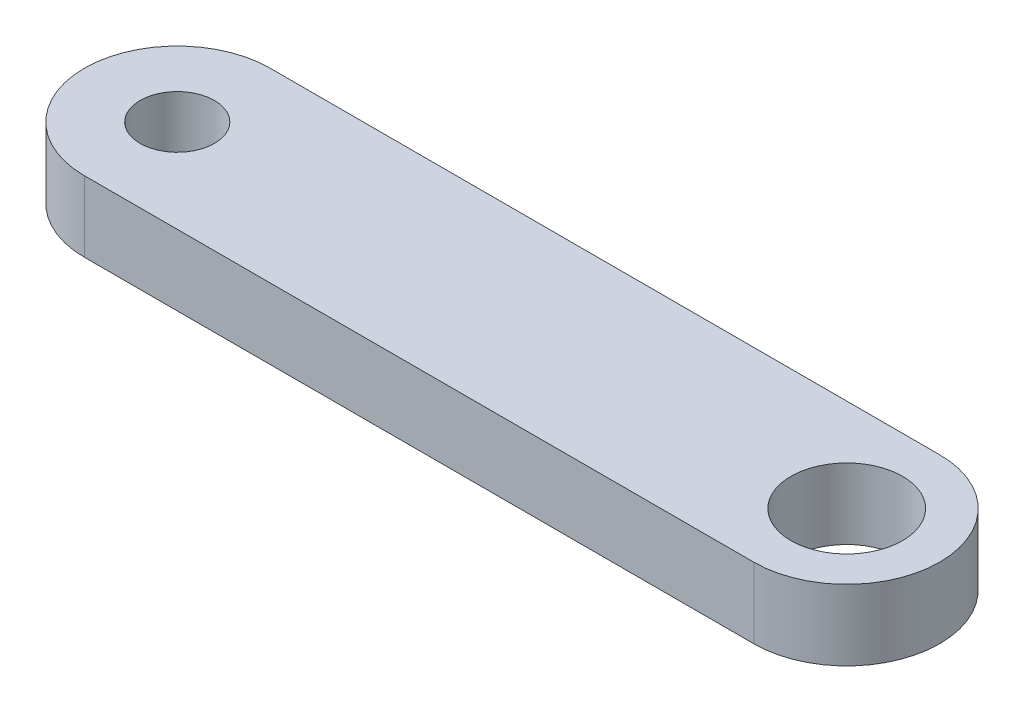
ISO-10303-21;
HEADER;
FILE_DESCRIPTION(('STEP AP214'),'2;1');
FILE_NAME('part.step','',(''),(''),'','','');
FILE_SCHEMA(('AUTOMOTIVE_DESIGN { 1 0 10303 214 1 1 1 1 }'));
ENDSEC;
DATA;
#1=APPLICATION_CONTEXT('core data for automotive mechanical design processes');
#2=APPLICATION_PROTOCOL_DEFINITION('international standard','automotive_design',2000,#1);
#3=PRODUCT_CONTEXT('',#1,'mechanical');
#4=PRODUCT('Part','Part','',(#3));
#5=PRODUCT_RELATED_PRODUCT_CATEGORY('part','',(#4));
#6=PRODUCT_DEFINITION_FORMATION('','',#4);
#7=PRODUCT_DEFINITION_CONTEXT('part definition',#1,'design');
#8=PRODUCT_DEFINITION('design','',#6,#7);
#9=PRODUCT_DEFINITION_SHAPE('','',#8);
#10=(LENGTH_UNIT() NAMED_UNIT(*) SI_UNIT(.MILLI.,.METRE.));
#11=(NAMED_UNIT(*) PLANE_ANGLE_UNIT() SI_UNIT($,.RADIAN.));
#12=(NAMED_UNIT(*) SI_UNIT($,.STERADIAN.) SOLID_ANGLE_UNIT());
#13=UNCERTAINTY_MEASURE_WITH_UNIT(LENGTH_MEASURE(1.E-05),#10,'distance_accuracy_value','');
#14=(GEOMETRIC_REPRESENTATION_CONTEXT(3) GLOBAL_UNCERTAINTY_ASSIGNED_CONTEXT((#13)) GLOBAL_UNIT_ASSIGNED_CONTEXT((#10,
#11,#12)) REPRESENTATION_CONTEXT('',''));
#15=CARTESIAN_POINT('',(0.,0.,0.));
#16=DIRECTION('',(0.,0.,1.));
#17=DIRECTION('',(1.,0.,0.));
#18=AXIS2_PLACEMENT_3D('',#15,#16,#17);
#19=CARTESIAN_POINT('',(9.,0.,0.));
#20=DIRECTION('',(0.,1.,0.));
#21=DIRECTION('',(0.,0.,1.));
#22=AXIS2_PLACEMENT_3D('',#19,#20,#21);
#23=PLANE('',#22);
#24=DIRECTION('',(-1.,0.,0.));
#25=VECTOR('',#24,1.);
#26=CARTESIAN_POINT('',(9.,0.,2.49999999999999));
#27=LINE('',#26,#25);
#28=CARTESIAN_POINT('',(9.,0.,2.49999999999999));
#29=VERTEX_POINT('',#28);
#30=CARTESIAN_POINT('',(-9.,0.,2.5));
#31=VERTEX_POINT('',#30);
#32=EDGE_CURVE('E60',#29,#31,#27,.T.);
#33=ORIENTED_EDGE('',*,*,#32,.T.);
#34=CARTESIAN_POINT('',(-9.,0.,0.));
#35=DIRECTION('',(0.,-1.,0.));
#36=DIRECTION('',(0.,0.,-1.));
#37=AXIS2_PLACEMENT_3D('',#34,#35,#36);
#38=CIRCLE('',#37,2.5);
#39=CARTESIAN_POINT('',(-9.00000000000001,0.,-2.5));
#40=VERTEX_POINT('',#39);
#41=EDGE_CURVE('E85',#40,#31,#38,.F.);
#42=ORIENTED_EDGE('',*,*,#41,.F.);
#43=DIRECTION('',(1.,0.,0.));
#44=VECTOR('',#43,1.);
#45=CARTESIAN_POINT('',(9.,0.,-2.50000000000001));
#46=LINE('',#45,#44);
#47=CARTESIAN_POINT('',(9.,0.,-2.50000000000001));
#48=VERTEX_POINT('',#47);
#49=EDGE_CURVE('E62',#40,#48,#46,.T.);
#50=ORIENTED_EDGE('',*,*,#49,.T.);
#51=CARTESIAN_POINT('',(9.,0.,0.));
#52=DIRECTION('',(0.,-1.,0.));
#53=DIRECTION('',(0.,0.,-1.));
#54=AXIS2_PLACEMENT_3D('',#51,#52,#53);
#55=CIRCLE('',#54,2.5);
#56=EDGE_CURVE('E56',#29,#48,#55,.F.);
#57=ORIENTED_EDGE('',*,*,#56,.F.);
#58=EDGE_LOOP('',(#33,#42,#50,#57));
#59=FACE_BOUND('',#58,.T.);
#60=CARTESIAN_POINT('',(9.,0.,0.));
#61=DIRECTION('',(0.,1.,0.));
#62=DIRECTION('',(0.,0.,1.));
#63=AXIS2_PLACEMENT_3D('',#60,#61,#62);
#64=CIRCLE('',#63,1.5);
#65=CARTESIAN_POINT('',(9.,0.,1.49999999999999));
#66=VERTEX_POINT('',#65);
#67=EDGE_CURVE('E66',#66,#66,#64,.T.);
#68=ORIENTED_EDGE('',*,*,#67,.T.);
#69=EDGE_LOOP('',(#68));
#70=FACE_BOUND('',#69,.T.);
#71=CARTESIAN_POINT('',(-9.,0.,0.));
#72=DIRECTION('',(0.,1.,0.));
#73=DIRECTION('',(0.,0.,1.));
#74=AXIS2_PLACEMENT_3D('',#71,#72,#73);
#75=CIRCLE('',#74,1.);
#76=CARTESIAN_POINT('',(-9.,0.,1.));
#77=VERTEX_POINT('',#76);
#78=EDGE_CURVE('E20',#77,#77,#75,.T.);
#79=ORIENTED_EDGE('',*,*,#78,.T.);
#80=EDGE_LOOP('',(#79));
#81=FACE_BOUND('',#80,.T.);
#82=ADVANCED_FACE('F17',(#59,#70,#81),#23,.F.);
#83=CARTESIAN_POINT('',(-9.,0.,0.));
#84=DIRECTION('',(0.,1.,0.));
#85=DIRECTION('',(0.,0.,1.));
#86=AXIS2_PLACEMENT_3D('',#83,#84,#85);
#87=CYLINDRICAL_SURFACE('',#86,1.);
#88=CARTESIAN_POINT('',(-9.,1.9,0.));
#89=DIRECTION('',(0.,1.,0.));
#90=DIRECTION('',(0.,0.,1.));
#91=AXIS2_PLACEMENT_3D('',#88,#89,#90);
#92=CIRCLE('',#91,1.);
#93=CARTESIAN_POINT('',(-9.,1.9,1.));
#94=VERTEX_POINT('',#93);
#95=EDGE_CURVE('E76',#94,#94,#92,.F.);
#96=ORIENTED_EDGE('',*,*,#95,.F.);
#97=EDGE_LOOP('',(#96));
#98=FACE_BOUND('',#97,.T.);
#99=ORIENTED_EDGE('',*,*,#78,.F.);
#100=EDGE_LOOP('',(#99));
#101=FACE_BOUND('',#100,.T.);
#102=ADVANCED_FACE('F99',(#98,#101),#87,.F.);
#103=CARTESIAN_POINT('',(9.,0.,0.));
#104=DIRECTION('',(0.,1.,0.));
#105=DIRECTION('',(0.,0.,1.));
#106=AXIS2_PLACEMENT_3D('',#103,#104,#105);
#107=CYLINDRICAL_SURFACE('',#106,1.5);
#108=CARTESIAN_POINT('',(9.,1.9,0.));
#109=DIRECTION('',(0.,1.,0.));
#110=DIRECTION('',(0.,0.,1.));
#111=AXIS2_PLACEMENT_3D('',#108,#109,#110);
#112=CIRCLE('',#111,1.5);
#113=CARTESIAN_POINT('',(9.,1.9,1.49999999999999));
#114=VERTEX_POINT('',#113);
#115=EDGE_CURVE('E79',#114,#114,#112,.F.);
#116=ORIENTED_EDGE('',*,*,#115,.F.);
#117=EDGE_LOOP('',(#116));
#118=FACE_BOUND('',#117,.T.);
#119=ORIENTED_EDGE('',*,*,#67,.F.);
#120=EDGE_LOOP('',(#119));
#121=FACE_BOUND('',#120,.T.);
#122=ADVANCED_FACE('F101',(#118,#121),#107,.F.);
#123=CARTESIAN_POINT('',(9.,1.9,0.));
#124=DIRECTION('',(0.,-1.,0.));
#125=DIRECTION('',(0.,0.,-1.));
#126=AXIS2_PLACEMENT_3D('',#123,#124,#125);
#127=CYLINDRICAL_SURFACE('',#126,2.5);
#128=CARTESIAN_POINT('',(9.,1.9,0.));
#129=DIRECTION('',(0.,-1.,0.));
#130=DIRECTION('',(0.,0.,-1.));
#131=AXIS2_PLACEMENT_3D('',#128,#129,#130);
#132=CIRCLE('',#131,2.5);
#133=CARTESIAN_POINT('',(9.,1.9,2.5));
#134=VERTEX_POINT('',#133);
#135=CARTESIAN_POINT('',(9.,1.9,-2.50000000000001));
#136=VERTEX_POINT('',#135);
#137=EDGE_CURVE('E72',#134,#136,#132,.F.);
#138=ORIENTED_EDGE('',*,*,#137,.F.);
#139=DIRECTION('',(0.,1.,0.));
#140=VECTOR('',#139,1.);
#141=CARTESIAN_POINT('',(9.,1.9,2.49999999999999));
#142=LINE('',#141,#140);
#143=EDGE_CURVE('E69',#134,#29,#142,.F.);
#144=ORIENTED_EDGE('',*,*,#143,.T.);
#145=ORIENTED_EDGE('',*,*,#56,.T.);
#146=DIRECTION('',(0.,1.,0.));
#147=VECTOR('',#146,1.);
#148=CARTESIAN_POINT('',(9.,1.9,-2.50000000000001));
#149=LINE('',#148,#147);
#150=EDGE_CURVE('E65',#48,#136,#149,.T.);
#151=ORIENTED_EDGE('',*,*,#150,.T.);
#152=EDGE_LOOP('',(#138,#144,#145,#151));
#153=FACE_BOUND('',#152,.T.);
#154=ADVANCED_FACE('F70',(#153),#127,.T.);
#155=CARTESIAN_POINT('',(9.,1.9,-2.50000000000001));
#156=DIRECTION('',(0.,0.,1.));
#157=DIRECTION('',(1.,0.,0.));
#158=AXIS2_PLACEMENT_3D('',#155,#156,#157);
#159=PLANE('',#158);
#160=DIRECTION('',(0.,-1.,0.));
#161=VECTOR('',#160,1.);
#162=CARTESIAN_POINT('',(-9.,1.9,-2.5));
#163=LINE('',#162,#161);
#164=CARTESIAN_POINT('',(-9.,1.9,-2.50000000000001));
#165=VERTEX_POINT('',#164);
#166=EDGE_CURVE('E92',#165,#40,#163,.T.);
#167=ORIENTED_EDGE('',*,*,#166,.F.);
#168=DIRECTION('',(1.,0.,0.));
#169=VECTOR('',#168,1.);
#170=CARTESIAN_POINT('',(9.,1.9,-2.50000000000001));
#171=LINE('',#170,#169);
#172=EDGE_CURVE('E88',#136,#165,#171,.F.);
#173=ORIENTED_EDGE('',*,*,#172,.F.);
#174=ORIENTED_EDGE('',*,*,#150,.F.);
#175=ORIENTED_EDGE('',*,*,#49,.F.);
#176=EDGE_LOOP('',(#167,#173,#174,#175));
#177=FACE_BOUND('',#176,.T.);
#178=ADVANCED_FACE('F124',(#177),#159,.F.);
#179=CARTESIAN_POINT('',(-9.,1.9,0.));
#180=DIRECTION('',(0.,-1.,0.));
#181=DIRECTION('',(0.,0.,-1.));
#182=AXIS2_PLACEMENT_3D('',#179,#180,#181);
#183=CYLINDRICAL_SURFACE('',#182,2.5);
#184=CARTESIAN_POINT('',(-9.,1.9,0.));
#185=DIRECTION('',(0.,-1.,0.));
#186=DIRECTION('',(0.,0.,-1.));
#187=AXIS2_PLACEMENT_3D('',#184,#185,#186);
#188=CIRCLE('',#187,2.5);
#189=CARTESIAN_POINT('',(-9.,1.9,2.5));
#190=VERTEX_POINT('',#189);
#191=EDGE_CURVE('E26',#165,#190,#188,.F.);
#192=ORIENTED_EDGE('',*,*,#191,.F.);
#193=ORIENTED_EDGE('',*,*,#166,.T.);
#194=ORIENTED_EDGE('',*,*,#41,.T.);
#195=DIRECTION('',(0.,1.,0.));
#196=VECTOR('',#195,1.);
#197=CARTESIAN_POINT('',(-9.,1.9,2.5));
#198=LINE('',#197,#196);
#199=EDGE_CURVE('E35',#31,#190,#198,.T.);
#200=ORIENTED_EDGE('',*,*,#199,.T.);
#201=EDGE_LOOP('',(#192,#193,#194,#200));
#202=FACE_BOUND('',#201,.T.);
#203=ADVANCED_FACE('F118',(#202),#183,.T.);
#204=CARTESIAN_POINT('',(9.,1.9,2.49999999999999));
#205=DIRECTION('',(0.,0.,-1.));
#206=DIRECTION('',(-1.,0.,0.));
#207=AXIS2_PLACEMENT_3D('',#204,#205,#206);
#208=PLANE('',#207);
#209=ORIENTED_EDGE('',*,*,#143,.F.);
#210=DIRECTION('',(1.,0.,0.));
#211=VECTOR('',#210,1.);
#212=CARTESIAN_POINT('',(9.,1.9,2.5));
#213=LINE('',#212,#211);
#214=EDGE_CURVE('E11',#190,#134,#213,.T.);
#215=ORIENTED_EDGE('',*,*,#214,.F.);
#216=ORIENTED_EDGE('',*,*,#199,.F.);
#217=ORIENTED_EDGE('',*,*,#32,.F.);
#218=EDGE_LOOP('',(#209,#215,#216,#217));
#219=FACE_BOUND('',#218,.T.);
#220=ADVANCED_FACE('F75',(#219),#208,.F.);
#221=CARTESIAN_POINT('',(9.,1.9,0.));
#222=DIRECTION('',(0.,1.,0.));
#223=DIRECTION('',(0.,0.,1.));
#224=AXIS2_PLACEMENT_3D('',#221,#222,#223);
#225=PLANE('',#224);
#226=ORIENTED_EDGE('',*,*,#191,.T.);
#227=ORIENTED_EDGE('',*,*,#214,.T.);
#228=ORIENTED_EDGE('',*,*,#137,.T.);
#229=ORIENTED_EDGE('',*,*,#172,.T.);
#230=EDGE_LOOP('',(#226,#227,#228,#229));
#231=FACE_BOUND('',#230,.T.);
#232=ORIENTED_EDGE('',*,*,#115,.T.);
#233=EDGE_LOOP('',(#232));
#234=FACE_BOUND('',#233,.T.);
#235=ORIENTED_EDGE('',*,*,#95,.T.);
#236=EDGE_LOOP('',(#235));
#237=FACE_BOUND('',#236,.T.);
#238=ADVANCED_FACE('F111',(#231,#234,#237),#225,.T.);
#239=CLOSED_SHELL('',(#82,#102,#122,#154,#178,#203,#220,#238));
#240=MANIFOLD_SOLID_BREP('B1',#239);
#241=ADVANCED_BREP_SHAPE_REPRESENTATION('',(#18,#240),#14);
#242=SHAPE_DEFINITION_REPRESENTATION(#9,#241);
ENDSEC;
END-ISO-10303-21;
